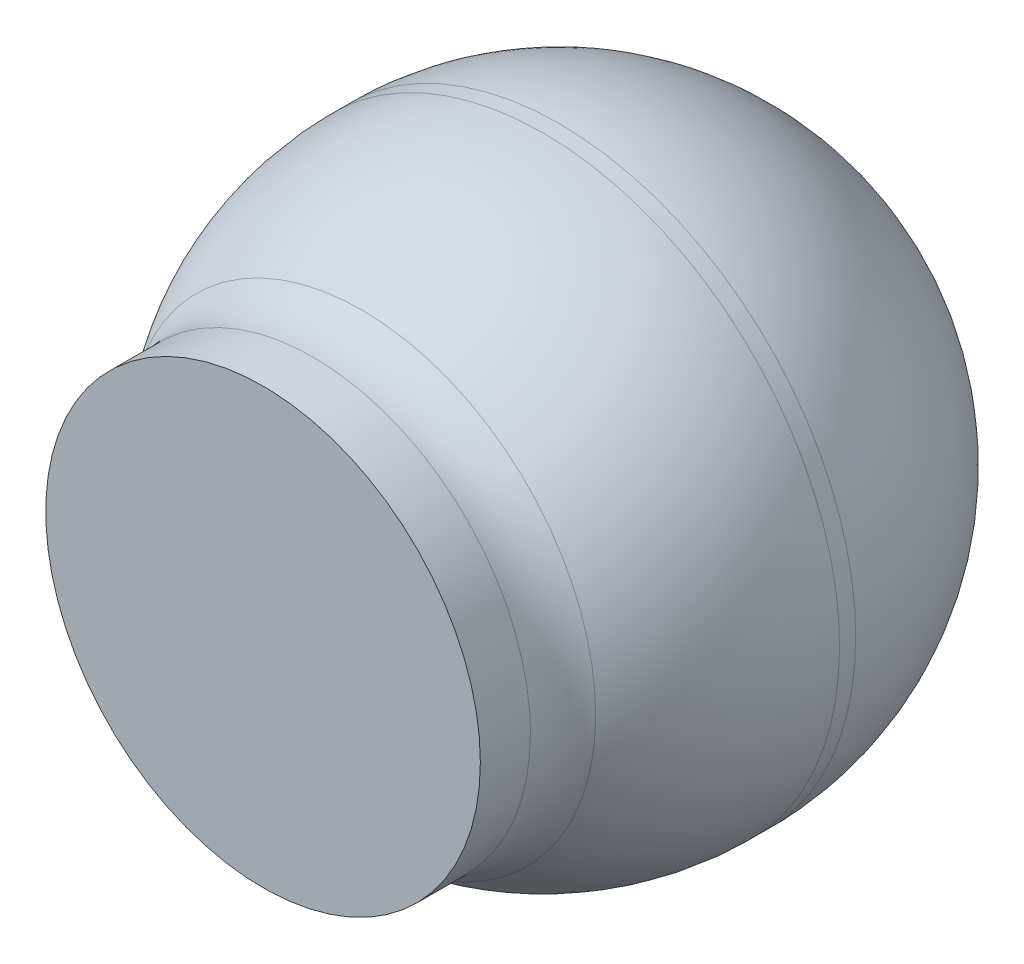
ISO-10303-21;
HEADER;
FILE_DESCRIPTION(('STEP AP214'),'2;1');
FILE_NAME('part.step','',(''),(''),'','','');
FILE_SCHEMA(('AUTOMOTIVE_DESIGN { 1 0 10303 214 1 1 1 1 }'));
ENDSEC;
DATA;
#1=APPLICATION_CONTEXT('core data for automotive mechanical design processes');
#2=APPLICATION_PROTOCOL_DEFINITION('international standard','automotive_design',2000,#1);
#3=PRODUCT_CONTEXT('',#1,'mechanical');
#4=PRODUCT('Part','Part','',(#3));
#5=PRODUCT_RELATED_PRODUCT_CATEGORY('part','',(#4));
#6=PRODUCT_DEFINITION_FORMATION('','',#4);
#7=PRODUCT_DEFINITION_CONTEXT('part definition',#1,'design');
#8=PRODUCT_DEFINITION('design','',#6,#7);
#9=PRODUCT_DEFINITION_SHAPE('','',#8);
#10=(LENGTH_UNIT() NAMED_UNIT(*) SI_UNIT(.MILLI.,.METRE.));
#11=(NAMED_UNIT(*) PLANE_ANGLE_UNIT() SI_UNIT($,.RADIAN.));
#12=(NAMED_UNIT(*) SI_UNIT($,.STERADIAN.) SOLID_ANGLE_UNIT());
#13=UNCERTAINTY_MEASURE_WITH_UNIT(LENGTH_MEASURE(1.E-05),#10,'distance_accuracy_value','');
#14=(GEOMETRIC_REPRESENTATION_CONTEXT(3) GLOBAL_UNCERTAINTY_ASSIGNED_CONTEXT((#13)) GLOBAL_UNIT_ASSIGNED_CONTEXT((#10,
#11,#12)) REPRESENTATION_CONTEXT('',''));
#15=CARTESIAN_POINT('',(0.,0.,0.));
#16=DIRECTION('',(0.,0.,1.));
#17=DIRECTION('',(1.,0.,0.));
#18=AXIS2_PLACEMENT_3D('',#15,#16,#17);
#19=CARTESIAN_POINT('',(1.977080077731,-4.051349291452,10.006534503384));
#20=DIRECTION('',(0.,0.,-1.));
#21=DIRECTION('',(-1.,0.,0.));
#22=AXIS2_PLACEMENT_3D('',#19,#20,#21);
#23=PLANE('',#22);
#24=CARTESIAN_POINT('',(1.977080077731,-4.051349291452,10.006534503384));
#25=DIRECTION('',(0.,0.,1.));
#26=DIRECTION('',(1.,0.,0.));
#27=AXIS2_PLACEMENT_3D('',#24,#25,#26);
#28=CIRCLE('',#27,0.275);
#29=CARTESIAN_POINT('',(2.252080077731,-4.051349291452,10.006534503384));
#30=VERTEX_POINT('',#29);
#31=EDGE_CURVE('E20',#30,#30,#28,.F.);
#32=ORIENTED_EDGE('',*,*,#31,.F.);
#33=EDGE_LOOP('',(#32));
#34=FACE_BOUND('',#33,.T.);
#35=ADVANCED_FACE('F17',(#34),#23,.F.);
#36=CARTESIAN_POINT('',(1.977080077731,-4.051349291452,9.906534503384));
#37=DIRECTION('',(0.,0.,1.));
#38=DIRECTION('',(1.,0.,0.));
#39=AXIS2_PLACEMENT_3D('',#36,#37,#38);
#40=CYLINDRICAL_SURFACE('',#39,0.275);
#41=CARTESIAN_POINT('',(1.977080077731,-4.051349291452,9.943180457728));
#42=DIRECTION('',(0.,0.,-1.));
#43=DIRECTION('',(0.996700902337583,0.0811622527992439,0.));
#44=AXIS2_PLACEMENT_3D('',#41,#42,#43);
#45=CIRCLE('',#44,0.275);
#46=CARTESIAN_POINT('',(2.25117282587384,-4.02902967193221,9.943180457728));
#47=VERTEX_POINT('',#46);
#48=EDGE_CURVE('E65',#47,#47,#45,.F.);
#49=ORIENTED_EDGE('',*,*,#48,.T.);
#50=EDGE_LOOP('',(#49));
#51=FACE_BOUND('',#50,.T.);
#52=ORIENTED_EDGE('',*,*,#31,.T.);
#53=EDGE_LOOP('',(#52));
#54=FACE_BOUND('',#53,.T.);
#55=ADVANCED_FACE('F62',(#51,#54),#40,.T.);
#56=CARTESIAN_POINT('',(1.977080077731,-4.051349291452,9.943180457728));
#57=DIRECTION('',(0.,0.,-1.));
#58=DIRECTION('',(0.996700902337583,0.0811622527992448,0.));
#59=AXIS2_PLACEMENT_3D('',#56,#57,#58);
#60=TOROIDAL_SURFACE('',#59,0.375,0.1);
#61=ORIENTED_EDGE('',*,*,#48,.F.);
#62=EDGE_LOOP('',(#61));
#63=FACE_BOUND('',#62,.T.);
#64=CARTESIAN_POINT('',(1.977080077731,-4.051349291452,9.881744931236));
#65=DIRECTION('',(0.,0.,-1.));
#66=DIRECTION('',(-0.996700902337598,-0.0811622527990593,0.));
#67=AXIS2_PLACEMENT_3D('',#64,#65,#66);
#68=CIRCLE('',#67,0.296097046412665);
#69=CARTESIAN_POINT('',(1.681959884392,-4.075381194786,9.881744931236));
#70=VERTEX_POINT('',#69);
#71=EDGE_CURVE('E39',#70,#70,#68,.T.);
#72=ORIENTED_EDGE('',*,*,#71,.F.);
#73=EDGE_LOOP('',(#72));
#74=FACE_BOUND('',#73,.T.);
#75=ADVANCED_FACE('F57',(#63,#74),#60,.F.);
#76=CARTESIAN_POINT('',(1.603317239355,-4.081785136252,9.651976062157));
#77=CARTESIAN_POINT('',(1.603317239355,-4.081785136252,9.701461392103));
#78=CARTESIAN_POINT('',(1.611473782652,-4.081120941579,9.750947004335));
#79=CARTESIAN_POINT('',(1.627792914651,-4.079792059952,9.798626332798));
#80=CARTESIAN_POINT('',(1.651658609162,-4.077848654938,9.842699544317));
#81=CARTESIAN_POINT('',(1.681959884392,-4.075381194786,9.881744931236));
#82=(BOUNDED_CURVE() B_SPLINE_CURVE(5,(#76,#77,#78,#79,#80,#81),.UNSPECIFIED.,.F.,
.F.) B_SPLINE_CURVE_WITH_KNOTS((6,6),(0.,0.661568582165),
.UNSPECIFIED.) CURVE() GEOMETRIC_REPRESENTATION_ITEM() RATIONAL_B_SPLINE_CURVE((1.,1.,1.,1.,1.,1.)) REPRESENTATION_ITEM(''));
#83=CARTESIAN_POINT('',(1.977080077731,-4.051349291452,9.651976062157));
#84=DIRECTION('',(0.,0.,-1.));
#85=AXIS1_PLACEMENT('',#83,#84);
#86=SURFACE_OF_REVOLUTION('',#82,#85);
#87=CARTESIAN_POINT('',(1.977080077731,-4.051349291452,9.651976062157));
#88=DIRECTION('',(0.,0.,1.));
#89=DIRECTION('',(1.,0.,0.));
#90=AXIS2_PLACEMENT_3D('',#87,#88,#89);
#91=CIRCLE('',#90,0.375);
#92=CARTESIAN_POINT('',(2.352080077731,-4.051349291452,9.651976062157));
#93=VERTEX_POINT('',#92);
#94=EDGE_CURVE('E36',#93,#93,#91,.F.);
#95=ORIENTED_EDGE('',*,*,#94,.F.);
#96=EDGE_LOOP('',(#95));
#97=FACE_BOUND('',#96,.T.);
#98=ORIENTED_EDGE('',*,*,#71,.T.);
#99=EDGE_LOOP('',(#98));
#100=FACE_BOUND('',#99,.T.);
#101=ADVANCED_FACE('F53',(#97,#100),#86,.F.);
#102=CARTESIAN_POINT('',(1.977080077731,-4.051349291452,9.256534503384));
#103=DIRECTION('',(0.,0.,1.));
#104=DIRECTION('',(1.,0.,0.));
#105=AXIS2_PLACEMENT_3D('',#102,#103,#104);
#106=CYLINDRICAL_SURFACE('',#105,0.375);
#107=CARTESIAN_POINT('',(1.977080077731,-4.051349291452,9.631534503384));
#108=DIRECTION('',(0.,0.,-1.));
#109=DIRECTION('',(0.0811622527992357,-0.996700902337583,0.));
#110=AXIS2_PLACEMENT_3D('',#107,#108,#109);
#111=CIRCLE('',#110,0.375);
#112=CARTESIAN_POINT('',(2.00751592253071,-4.42511212982859,9.631534503384));
#113=VERTEX_POINT('',#112);
#114=CARTESIAN_POINT('',(1.94664423293129,-3.67758645307541,9.631534503384));
#115=VERTEX_POINT('',#114);
#116=EDGE_CURVE('E11',#113,#115,#111,.T.);
#117=ORIENTED_EDGE('',*,*,#116,.F.);
#118=CARTESIAN_POINT('',(1.977080077731,-4.051349291452,9.631534503384));
#119=DIRECTION('',(0.,0.,1.));
#120=DIRECTION('',(0.0811622527992365,-0.996700902337583,0.));
#121=AXIS2_PLACEMENT_3D('',#118,#119,#120);
#122=CIRCLE('',#121,0.375);
#123=EDGE_CURVE('E25',#115,#113,#122,.F.);
#124=ORIENTED_EDGE('',*,*,#123,.F.);
#125=EDGE_LOOP('',(#117,#124));
#126=FACE_BOUND('',#125,.T.);
#127=ORIENTED_EDGE('',*,*,#94,.T.);
#128=EDGE_LOOP('',(#127));
#129=FACE_BOUND('',#128,.T.);
#130=ADVANCED_FACE('F34',(#126,#129),#106,.T.);
#131=CARTESIAN_POINT('',(1.977080077731,-4.051349291452,9.631534503384));
#132=DIRECTION('',(0.0811622527992361,-0.996700902337583,0.));
#133=DIRECTION('',(-0.996700902337583,-0.0811622527992361,0.));
#134=AXIS2_PLACEMENT_3D('',#131,#132,#133);
#135=SPHERICAL_SURFACE('',#134,0.375);
#136=ORIENTED_EDGE('',*,*,#123,.T.);
#137=ORIENTED_EDGE('',*,*,#116,.T.);
#138=EDGE_LOOP('',(#136,#137));
#139=FACE_BOUND('',#138,.T.);
#140=ADVANCED_FACE('F32',(#139),#135,.T.);
#141=CLOSED_SHELL('',(#35,#55,#75,#101,#130,#140));
#142=MANIFOLD_SOLID_BREP('B1',#141);
#143=ADVANCED_BREP_SHAPE_REPRESENTATION('',(#18,#142),#14);
#144=SHAPE_DEFINITION_REPRESENTATION(#9,#143);
ENDSEC;
END-ISO-10303-21;
